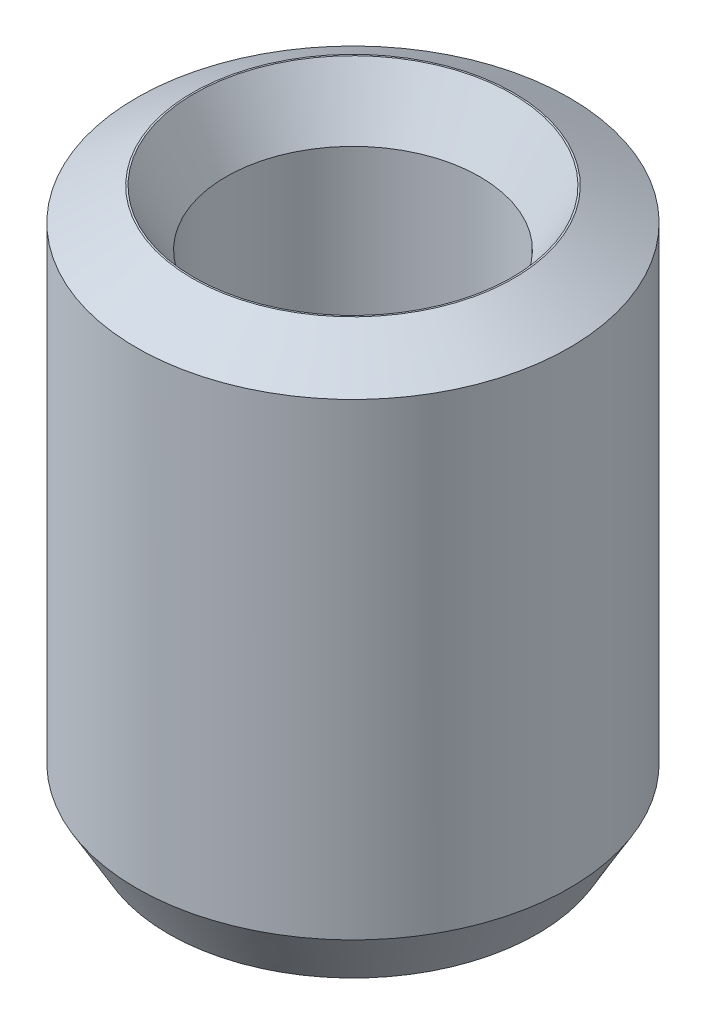
ISO-10303-21;
HEADER;
FILE_DESCRIPTION(('STEP AP214'),'2;1');
FILE_NAME('part.step','',(''),(''),'','','');
FILE_SCHEMA(('AUTOMOTIVE_DESIGN { 1 0 10303 214 1 1 1 1 }'));
ENDSEC;
DATA;
#1=APPLICATION_CONTEXT('core data for automotive mechanical design processes');
#2=APPLICATION_PROTOCOL_DEFINITION('international standard','automotive_design',2000,#1);
#3=PRODUCT_CONTEXT('',#1,'mechanical');
#4=PRODUCT('Part','Part','',(#3));
#5=PRODUCT_RELATED_PRODUCT_CATEGORY('part','',(#4));
#6=PRODUCT_DEFINITION_FORMATION('','',#4);
#7=PRODUCT_DEFINITION_CONTEXT('part definition',#1,'design');
#8=PRODUCT_DEFINITION('design','',#6,#7);
#9=PRODUCT_DEFINITION_SHAPE('','',#8);
#10=(LENGTH_UNIT() NAMED_UNIT(*) SI_UNIT(.MILLI.,.METRE.));
#11=(NAMED_UNIT(*) PLANE_ANGLE_UNIT() SI_UNIT($,.RADIAN.));
#12=(NAMED_UNIT(*) SI_UNIT($,.STERADIAN.) SOLID_ANGLE_UNIT());
#13=UNCERTAINTY_MEASURE_WITH_UNIT(LENGTH_MEASURE(1.E-05),#10,'distance_accuracy_value','');
#14=(GEOMETRIC_REPRESENTATION_CONTEXT(3) GLOBAL_UNCERTAINTY_ASSIGNED_CONTEXT((#13)) GLOBAL_UNIT_ASSIGNED_CONTEXT((#10,
#11,#12)) REPRESENTATION_CONTEXT('',''));
#15=CARTESIAN_POINT('',(0.,0.,0.));
#16=DIRECTION('',(0.,0.,1.));
#17=DIRECTION('',(1.,0.,0.));
#18=AXIS2_PLACEMENT_3D('',#15,#16,#17);
#19=CARTESIAN_POINT('',(0.,64.2094614096517,0.));
#20=DIRECTION('',(0.,-1.,0.));
#21=DIRECTION('',(0.,0.,-1.));
#22=AXIS2_PLACEMENT_3D('',#19,#20,#21);
#23=CYLINDRICAL_SURFACE('',#22,25.);
#24=CARTESIAN_POINT('',(0.,6.43789802750815,0.));
#25=DIRECTION('',(0.,1.,0.));
#26=DIRECTION('',(0.,0.,1.));
#27=AXIS2_PLACEMENT_3D('',#24,#25,#26);
#28=CIRCLE('',#27,25.);
#29=CARTESIAN_POINT('',(0.,6.43789802750815,25.));
#30=VERTEX_POINT('',#29);
#31=EDGE_CURVE('E10',#30,#30,#28,.T.);
#32=ORIENTED_EDGE('',*,*,#31,.T.);
#33=EDGE_LOOP('',(#32));
#34=FACE_BOUND('',#33,.T.);
#35=CARTESIAN_POINT('',(0.,60.4925392504545,0.));
#36=DIRECTION('',(0.,1.,0.));
#37=DIRECTION('',(0.,0.,1.));
#38=AXIS2_PLACEMENT_3D('',#35,#36,#37);
#39=CIRCLE('',#38,25.);
#40=CARTESIAN_POINT('',(0.,60.4925392504545,-25.));
#41=VERTEX_POINT('',#40);
#42=EDGE_CURVE('E50',#41,#41,#39,.F.);
#43=ORIENTED_EDGE('',*,*,#42,.T.);
#44=EDGE_LOOP('',(#43));
#45=FACE_BOUND('',#44,.T.);
#46=ADVANCED_FACE('F39',(#34,#45),#23,.T.);
#47=CARTESIAN_POINT('',(0.,64.2094614096517,0.));
#48=DIRECTION('',(0.,1.,0.));
#49=DIRECTION('',(0.,0.,1.));
#50=AXIS2_PLACEMENT_3D('',#47,#48,#49);
#51=PLANE('',#50);
#52=CARTESIAN_POINT('',(0.,64.2094614096517,0.));
#53=DIRECTION('',(0.,1.,0.));
#54=DIRECTION('',(0.,0.,1.));
#55=AXIS2_PLACEMENT_3D('',#52,#53,#54);
#56=CIRCLE('',#55,18.3730531408913);
#57=CARTESIAN_POINT('',(0.,64.2094614096517,18.3730531408913));
#58=VERTEX_POINT('',#57);
#59=EDGE_CURVE('E58',#58,#58,#56,.F.);
#60=ORIENTED_EDGE('',*,*,#59,.T.);
#61=EDGE_LOOP('',(#60));
#62=FACE_BOUND('',#61,.T.);
#63=CARTESIAN_POINT('',(0.,64.2094614096517,0.));
#64=DIRECTION('',(0.,1.,0.));
#65=DIRECTION('',(0.,0.,1.));
#66=AXIS2_PLACEMENT_3D('',#63,#64,#65);
#67=CIRCLE('',#66,18.5621019724918);
#68=CARTESIAN_POINT('',(0.,64.2094614096517,-18.5621019724918));
#69=VERTEX_POINT('',#68);
#70=EDGE_CURVE('E61',#69,#69,#67,.T.);
#71=ORIENTED_EDGE('',*,*,#70,.T.);
#72=EDGE_LOOP('',(#71));
#73=FACE_BOUND('',#72,.T.);
#74=ADVANCED_FACE('F88',(#62,#73),#51,.T.);
#75=CARTESIAN_POINT('',(0.,0.,0.));
#76=DIRECTION('',(0.,1.,0.));
#77=DIRECTION('',(0.,0.,1.));
#78=AXIS2_PLACEMENT_3D('',#75,#76,#77);
#79=PLANE('',#78);
#80=CARTESIAN_POINT('',(0.,0.,0.));
#81=DIRECTION('',(0.,1.,0.));
#82=DIRECTION('',(0.,0.,1.));
#83=AXIS2_PLACEMENT_3D('',#80,#81,#82);
#84=CIRCLE('',#83,21.0940290092022);
#85=CARTESIAN_POINT('',(0.,0.,-21.0940290092022));
#86=VERTEX_POINT('',#85);
#87=EDGE_CURVE('E51',#86,#86,#84,.T.);
#88=ORIENTED_EDGE('',*,*,#87,.T.);
#89=EDGE_LOOP('',(#88));
#90=FACE_BOUND('',#89,.T.);
#91=CARTESIAN_POINT('',(0.,0.,0.));
#92=DIRECTION('',(0.,1.,0.));
#93=DIRECTION('',(0.,0.,1.));
#94=AXIS2_PLACEMENT_3D('',#91,#92,#93);
#95=CIRCLE('',#94,21.2830778408028);
#96=CARTESIAN_POINT('',(0.,0.,21.2830778408028));
#97=VERTEX_POINT('',#96);
#98=EDGE_CURVE('E54',#97,#97,#95,.F.);
#99=ORIENTED_EDGE('',*,*,#98,.T.);
#100=EDGE_LOOP('',(#99));
#101=FACE_BOUND('',#100,.T.);
#102=ADVANCED_FACE('F83',(#90,#101),#79,.F.);
#103=CARTESIAN_POINT('',(0.,64.2094614096517,0.));
#104=DIRECTION('',(0.,-1.,0.));
#105=DIRECTION('',(0.,0.,-1.));
#106=AXIS2_PLACEMENT_3D('',#103,#104,#105);
#107=CYLINDRICAL_SURFACE('',#106,14.6561309816941);
#108=CARTESIAN_POINT('',(0.,57.7715633821436,0.));
#109=DIRECTION('',(0.,1.,0.));
#110=DIRECTION('',(0.,0.,1.));
#111=AXIS2_PLACEMENT_3D('',#108,#109,#110);
#112=CIRCLE('',#111,14.6561309816941);
#113=CARTESIAN_POINT('',(0.,57.7715633821436,14.6561309816941));
#114=VERTEX_POINT('',#113);
#115=EDGE_CURVE('E67',#114,#114,#112,.T.);
#116=ORIENTED_EDGE('',*,*,#115,.T.);
#117=EDGE_LOOP('',(#116));
#118=FACE_BOUND('',#117,.T.);
#119=CARTESIAN_POINT('',(0.,3.71692215919722,0.));
#120=DIRECTION('',(0.,1.,0.));
#121=DIRECTION('',(0.,0.,1.));
#122=AXIS2_PLACEMENT_3D('',#119,#120,#121);
#123=CIRCLE('',#122,14.6561309816941);
#124=CARTESIAN_POINT('',(0.,3.71692215919722,-14.6561309816941));
#125=VERTEX_POINT('',#124);
#126=EDGE_CURVE('E69',#125,#125,#123,.F.);
#127=ORIENTED_EDGE('',*,*,#126,.T.);
#128=EDGE_LOOP('',(#127));
#129=FACE_BOUND('',#128,.T.);
#130=ADVANCED_FACE('F71',(#118,#129),#107,.F.);
#131=CARTESIAN_POINT('',(0.,57.7715633821436,0.));
#132=DIRECTION('',(0.,1.,0.));
#133=DIRECTION('',(0.,0.,1.));
#134=AXIS2_PLACEMENT_3D('',#131,#132,#133);
#135=CONICAL_SURFACE('',#134,14.6561309816941,0.523598775598302);
#136=ORIENTED_EDGE('',*,*,#59,.F.);
#137=EDGE_LOOP('',(#136));
#138=FACE_BOUND('',#137,.T.);
#139=ORIENTED_EDGE('',*,*,#115,.F.);
#140=EDGE_LOOP('',(#139));
#141=FACE_BOUND('',#140,.T.);
#142=ADVANCED_FACE('F77',(#138,#141),#135,.F.);
#143=CARTESIAN_POINT('',(0.,0.,0.));
#144=DIRECTION('',(0.,-1.,0.));
#145=DIRECTION('',(0.,0.,-1.));
#146=AXIS2_PLACEMENT_3D('',#143,#144,#145);
#147=CONICAL_SURFACE('',#146,21.0940290092022,1.04719755119659);
#148=CARTESIAN_POINT('',(0.,3.71692215919722,-14.6561309816941));
#149=CARTESIAN_POINT('',(0.,3.67820422003892,-14.7231924194806));
#150=CARTESIAN_POINT('',(0.,3.63948628088061,-14.7902538572672));
#151=CARTESIAN_POINT('',(0.,3.562050402564,-14.9243767328403));
#152=CARTESIAN_POINT('',(0.,3.5233324634057,-14.9914381706268));
#153=CARTESIAN_POINT('',(0.,3.44589658508909,-15.1255610461999));
#154=CARTESIAN_POINT('',(0.,3.40717864593079,-15.1926224839864));
#155=CARTESIAN_POINT('',(0.,3.32974276761418,-15.3267453595595));
#156=CARTESIAN_POINT('',(0.,3.29102482845587,-15.3938067973461));
#157=CARTESIAN_POINT('',(0.,3.21358895013926,-15.5279296729192));
#158=CARTESIAN_POINT('',(0.,3.17487101098096,-15.5949911107057));
#159=CARTESIAN_POINT('',(0.,3.09743513266435,-15.7291139862788));
#160=CARTESIAN_POINT('',(0.,3.05871719350605,-15.7961754240653));
#161=CARTESIAN_POINT('',(0.,2.98128131518944,-15.9302982996384));
#162=CARTESIAN_POINT('',(0.,2.94256337603113,-15.997359737425));
#163=CARTESIAN_POINT('',(0.,2.86512749771453,-16.131482612998));
#164=CARTESIAN_POINT('',(0.,2.82640955855622,-16.1985440507846));
#165=CARTESIAN_POINT('',(0.,2.74897368023961,-16.3326669263577));
#166=CARTESIAN_POINT('',(0.,2.71025574108131,-16.3997283641442));
#167=CARTESIAN_POINT('',(0.,2.6328198627647,-16.5338512397173));
#168=CARTESIAN_POINT('',(0.,2.59410192360639,-16.6009126775038));
#169=CARTESIAN_POINT('',(0.,2.51666604528979,-16.7350355530769));
#170=CARTESIAN_POINT('',(0.,2.47794810613148,-16.8020969908635));
#171=CARTESIAN_POINT('',(0.,2.40051222781487,-16.9362198664366));
#172=CARTESIAN_POINT('',(0.,2.36179428865657,-17.0032813042231));
#173=CARTESIAN_POINT('',(0.,2.28435841033996,-17.1374041797962));
#174=CARTESIAN_POINT('',(0.,2.24564047118165,-17.2044656175827));
#175=CARTESIAN_POINT('',(0.,2.16820459286505,-17.3385884931558));
#176=CARTESIAN_POINT('',(0.,2.12948665370674,-17.4056499309424));
#177=CARTESIAN_POINT('',(0.,2.05205077539013,-17.5397728065155));
#178=CARTESIAN_POINT('',(0.,2.01333283623183,-17.606834244302));
#179=CARTESIAN_POINT('',(0.,1.93589695791522,-17.7409571198751));
#180=CARTESIAN_POINT('',(0.,1.89717901875692,-17.8080185576616));
#181=CARTESIAN_POINT('',(0.,1.81974314044031,-17.9421414332347));
#182=CARTESIAN_POINT('',(0.,1.781025201282,-18.0092028710213));
#183=CARTESIAN_POINT('',(0.,1.70358932296539,-18.1433257465943));
#184=CARTESIAN_POINT('',(0.,1.66487138380709,-18.2103871843809));
#185=CARTESIAN_POINT('',(0.,1.58743550549048,-18.344510059954));
#186=CARTESIAN_POINT('',(0.,1.54871756633218,-18.4115714977405));
#187=CARTESIAN_POINT('',(0.,1.47128168801557,-18.5456943733136));
#188=CARTESIAN_POINT('',(0.,1.43256374885726,-18.6127558111001));
#189=CARTESIAN_POINT('',(0.,1.35512787054065,-18.7468786866732));
#190=CARTESIAN_POINT('',(0.,1.31640993138235,-18.8139401244598));
#191=CARTESIAN_POINT('',(0.,1.23897405306574,-18.9480630000329));
#192=CARTESIAN_POINT('',(0.,1.20025611390744,-19.0151244378194));
#193=CARTESIAN_POINT('',(0.,1.12282023559083,-19.1492473133925));
#194=CARTESIAN_POINT('',(0.,1.08410229643252,-19.216308751179));
#195=CARTESIAN_POINT('',(0.,1.00666641811591,-19.3504316267521));
#196=CARTESIAN_POINT('',(0.,0.96794847895761,-19.4174930645387));
#197=CARTESIAN_POINT('',(0.,0.890512600641001,-19.5516159401118));
#198=CARTESIAN_POINT('',(0.,0.851794661482697,-19.6186773778983));
#199=CARTESIAN_POINT('',(0.,0.774358783166088,-19.7528002534714));
#200=CARTESIAN_POINT('',(0.,0.735640844007783,-19.8198616912579));
#201=CARTESIAN_POINT('',(0.,0.658204965691175,-19.953984566831));
#202=CARTESIAN_POINT('',(0.,0.61948702653287,-20.0210460046176));
#203=CARTESIAN_POINT('',(0.,0.542051148216262,-20.1551688801906));
#204=CARTESIAN_POINT('',(0.,0.503333209057957,-20.2222303179772));
#205=CARTESIAN_POINT('',(0.,0.425897330741348,-20.3563531935503));
#206=CARTESIAN_POINT('',(0.,0.387179391583044,-20.4234146313368));
#207=CARTESIAN_POINT('',(0.,0.309743513266435,-20.5575375069099));
#208=CARTESIAN_POINT('',(0.,0.271025574108131,-20.6245989446964));
#209=CARTESIAN_POINT('',(0.,0.193589695791522,-20.7587218202695));
#210=CARTESIAN_POINT('',(0.,0.154871756633218,-20.8257832580561));
#211=CARTESIAN_POINT('',(0.,0.0774358783166088,-20.9599061336292));
#212=CARTESIAN_POINT('',(0.,0.0387179391583044,-21.0269675714157));
#213=CARTESIAN_POINT('',(0.,0.,-21.0940290092022));
#214=B_SPLINE_CURVE_WITH_KNOTS('',3,(#148,#149,#150,#151,#152,#153,#154,#155,#156,#157,#158,
#159,#160,#161,#162,#163,#164,#165,#166,#167,#168,#169,#170,#171,#172,#173,#174,#175,#176,#177,
#178,#179,#180,#181,#182,#183,#184,#185,#186,#187,#188,#189,#190,#191,#192,#193,#194,#195,#196,
#197,#198,#199,#200,#201,#202,#203,#204,#205,#206,#207,#208,#209,#210,#211,#212,#213),
.UNSPECIFIED.,.F.,.F.,(4,2,2,2,2,2,2,2,2,2,2,2,2,2,2,2,2,2,2,2,2,2,2,2,2,2,2,2,2,2,2,2,4),(0.,
0.232307634949825,0.46461526989965,0.696922904849476,0.929230539799301,1.16153817474913,
1.39384580969895,1.62615344464878,1.8584610795986,2.09076871454843,2.32307634949825,
2.55538398444808,2.7876916193979,3.01999925434773,3.25230688929755,3.48461452424738,
3.7169221591972,3.94922979414703,4.18153742909685,4.41384506404668,4.6461526989965,
4.87846033394633,5.11076796889615,5.34307560384598,5.57538323879581,5.80769087374563,
6.03999850869546,6.27230614364528,6.50461377859511,6.73692141354493,6.96922904849476,
7.20153668344458,7.43384431839441),.UNSPECIFIED.);
#215=EDGE_CURVE('BSEAM73',#125,#86,#214,.T.);
#216=ORIENTED_EDGE('',*,*,#126,.F.);
#217=ORIENTED_EDGE('',*,*,#87,.F.);
#218=ORIENTED_EDGE('',*,*,#215,.T.);
#219=ORIENTED_EDGE('',*,*,#215,.F.);
#220=EDGE_LOOP('',(#216,#218,#217,#219));
#221=FACE_BOUND('',#220,.T.);
#222=ADVANCED_FACE('F73',(#221),#147,.F.);
#223=CARTESIAN_POINT('',(0.,6.43789802750815,0.));
#224=DIRECTION('',(0.,1.,0.));
#225=DIRECTION('',(0.,0.,1.));
#226=AXIS2_PLACEMENT_3D('',#223,#224,#225);
#227=CONICAL_SURFACE('',#226,25.,0.523598775598302);
#228=ORIENTED_EDGE('',*,*,#98,.F.);
#229=EDGE_LOOP('',(#228));
#230=FACE_BOUND('',#229,.T.);
#231=ORIENTED_EDGE('',*,*,#31,.F.);
#232=EDGE_LOOP('',(#231));
#233=FACE_BOUND('',#232,.T.);
#234=ADVANCED_FACE('F76',(#230,#233),#227,.T.);
#235=CARTESIAN_POINT('',(0.,64.2094614096517,0.));
#236=DIRECTION('',(0.,-1.,0.));
#237=DIRECTION('',(0.,0.,-1.));
#238=AXIS2_PLACEMENT_3D('',#235,#236,#237);
#239=CONICAL_SURFACE('',#238,18.5621019724918,1.0471975511966);
#240=CARTESIAN_POINT('',(0.,60.4925392504545,-25.));
#241=CARTESIAN_POINT('',(0.,60.5312571896128,-24.9329385622135));
#242=CARTESIAN_POINT('',(0.,60.5699751287711,-24.8658771244269));
#243=CARTESIAN_POINT('',(0.,60.6474110070877,-24.7317542488538));
#244=CARTESIAN_POINT('',(0.,60.686128946246,-24.6646928110673));
#245=CARTESIAN_POINT('',(0.,60.7635648245626,-24.5305699354942));
#246=CARTESIAN_POINT('',(0.,60.8022827637209,-24.4635084977077));
#247=CARTESIAN_POINT('',(0.,60.8797186420376,-24.3293856221346));
#248=CARTESIAN_POINT('',(0.,60.9184365811959,-24.262324184348));
#249=CARTESIAN_POINT('',(0.,60.9958724595125,-24.1282013087749));
#250=CARTESIAN_POINT('',(0.,61.0345903986708,-24.0611398709884));
#251=CARTESIAN_POINT('',(0.,61.1120262769874,-23.9270169954153));
#252=CARTESIAN_POINT('',(0.,61.1507442161457,-23.8599555576288));
#253=CARTESIAN_POINT('',(0.,61.2281800944623,-23.7258326820557));
#254=CARTESIAN_POINT('',(0.,61.2668980336206,-23.6587712442691));
#255=CARTESIAN_POINT('',(0.,61.3443339119372,-23.5246483686961));
#256=CARTESIAN_POINT('',(0.,61.3830518510955,-23.4575869309095));
#257=CARTESIAN_POINT('',(0.,61.4604877294121,-23.3234640553364));
#258=CARTESIAN_POINT('',(0.,61.4992056685704,-23.2564026175499));
#259=CARTESIAN_POINT('',(0.,61.576641546887,-23.1222797419768));
#260=CARTESIAN_POINT('',(0.,61.6153594860453,-23.0552183041903));
#261=CARTESIAN_POINT('',(0.,61.6927953643619,-22.9210954286172));
#262=CARTESIAN_POINT('',(0.,61.7315133035203,-22.8540339908306));
#263=CARTESIAN_POINT('',(0.,61.8089491818369,-22.7199111152575));
#264=CARTESIAN_POINT('',(0.,61.8476671209952,-22.652849677471));
#265=CARTESIAN_POINT('',(0.,61.9251029993118,-22.5187268018979));
#266=CARTESIAN_POINT('',(0.,61.9638209384701,-22.4516653641114));
#267=CARTESIAN_POINT('',(0.,62.0412568167867,-22.3175424885383));
#268=CARTESIAN_POINT('',(0.,62.079974755945,-22.2504810507517));
#269=CARTESIAN_POINT('',(0.,62.1574106342616,-22.1163581751786));
#270=CARTESIAN_POINT('',(0.,62.1961285734199,-22.0492967373921));
#271=CARTESIAN_POINT('',(0.,62.2735644517365,-21.915173861819));
#272=CARTESIAN_POINT('',(0.,62.3122823908948,-21.8481124240325));
#273=CARTESIAN_POINT('',(0.,62.3897182692114,-21.7139895484594));
#274=CARTESIAN_POINT('',(0.,62.4284362083697,-21.6469281106728));
#275=CARTESIAN_POINT('',(0.,62.5058720866863,-21.5128052350998));
#276=CARTESIAN_POINT('',(0.,62.5445900258446,-21.4457437973132));
#277=CARTESIAN_POINT('',(0.,62.6220259041612,-21.3116209217401));
#278=CARTESIAN_POINT('',(0.,62.6607438433196,-21.2445594839536));
#279=CARTESIAN_POINT('',(0.,62.7381797216362,-21.1104366083805));
#280=CARTESIAN_POINT('',(0.,62.7768976607945,-21.043375170594));
#281=CARTESIAN_POINT('',(0.,62.8543335391111,-20.9092522950209));
#282=CARTESIAN_POINT('',(0.,62.8930514782694,-20.8421908572343));
#283=CARTESIAN_POINT('',(0.,62.970487356586,-20.7080679816612));
#284=CARTESIAN_POINT('',(0.,63.0092052957443,-20.6410065438747));
#285=CARTESIAN_POINT('',(0.,63.0866411740609,-20.5068836683016));
#286=CARTESIAN_POINT('',(0.,63.1253591132192,-20.4398222305151));
#287=CARTESIAN_POINT('',(0.,63.2027949915358,-20.305699354942));
#288=CARTESIAN_POINT('',(0.,63.2415129306941,-20.2386379171554));
#289=CARTESIAN_POINT('',(0.,63.3189488090107,-20.1045150415823));
#290=CARTESIAN_POINT('',(0.,63.357666748169,-20.0374536037958));
#291=CARTESIAN_POINT('',(0.,63.4351026264856,-19.9033307282227));
#292=CARTESIAN_POINT('',(0.,63.4738205656439,-19.8362692904362));
#293=CARTESIAN_POINT('',(0.,63.5512564439605,-19.7021464148631));
#294=CARTESIAN_POINT('',(0.,63.5899743831189,-19.6350849770765));
#295=CARTESIAN_POINT('',(0.,63.6674102614355,-19.5009621015035));
#296=CARTESIAN_POINT('',(0.,63.7061282005938,-19.4339006637169));
#297=CARTESIAN_POINT('',(0.,63.7835640789104,-19.2997777881438));
#298=CARTESIAN_POINT('',(0.,63.8222820180687,-19.2327163503573));
#299=CARTESIAN_POINT('',(0.,63.8997178963853,-19.0985934747842));
#300=CARTESIAN_POINT('',(0.,63.9384358355436,-19.0315320369977));
#301=CARTESIAN_POINT('',(0.,64.0158717138602,-18.8974091614246));
#302=CARTESIAN_POINT('',(0.,64.0545896530185,-18.830347723638));
#303=CARTESIAN_POINT('',(0.,64.1320255313351,-18.6962248480649));
#304=CARTESIAN_POINT('',(0.,64.1707434704934,-18.6291634102784));
#305=CARTESIAN_POINT('',(0.,64.2094614096517,-18.5621019724918));
#306=B_SPLINE_CURVE_WITH_KNOTS('',3,(#240,#241,#242,#243,#244,#245,#246,#247,#248,#249,#250,
#251,#252,#253,#254,#255,#256,#257,#258,#259,#260,#261,#262,#263,#264,#265,#266,#267,#268,#269,
#270,#271,#272,#273,#274,#275,#276,#277,#278,#279,#280,#281,#282,#283,#284,#285,#286,#287,#288,
#289,#290,#291,#292,#293,#294,#295,#296,#297,#298,#299,#300,#301,#302,#303,#304,#305),
.UNSPECIFIED.,.F.,.F.,(4,2,2,2,2,2,2,2,2,2,2,2,2,2,2,2,2,2,2,2,2,2,2,2,2,2,2,2,2,2,2,2,4),(0.,
0.232307634949826,0.464615269899652,0.696922904849478,0.929230539799301,1.16153817474913,
1.39384580969895,1.62615344464878,1.8584610795986,2.09076871454843,2.32307634949825,
2.55538398444808,2.7876916193979,3.01999925434773,3.25230688929755,3.48461452424738,
3.7169221591972,3.94922979414703,4.18153742909685,4.41384506404668,4.6461526989965,
4.87846033394633,5.11076796889616,5.34307560384598,5.57538323879581,5.80769087374563,
6.03999850869546,6.27230614364528,6.50461377859511,6.73692141354494,6.96922904849476,
7.20153668344459,7.43384431839442),.UNSPECIFIED.);
#307=EDGE_CURVE('BSEAM45',#41,#69,#306,.T.);
#308=ORIENTED_EDGE('',*,*,#42,.F.);
#309=ORIENTED_EDGE('',*,*,#70,.F.);
#310=ORIENTED_EDGE('',*,*,#307,.T.);
#311=ORIENTED_EDGE('',*,*,#307,.F.);
#312=EDGE_LOOP('',(#308,#310,#309,#311));
#313=FACE_BOUND('',#312,.T.);
#314=ADVANCED_FACE('F45',(#313),#239,.T.);
#315=CLOSED_SHELL('',(#46,#74,#102,#130,#142,#222,#234,#314));
#316=MANIFOLD_SOLID_BREP('B2',#315);
#317=ADVANCED_BREP_SHAPE_REPRESENTATION('',(#18,#316),#14);
#318=SHAPE_DEFINITION_REPRESENTATION(#9,#317);
ENDSEC;
END-ISO-10303-21;
